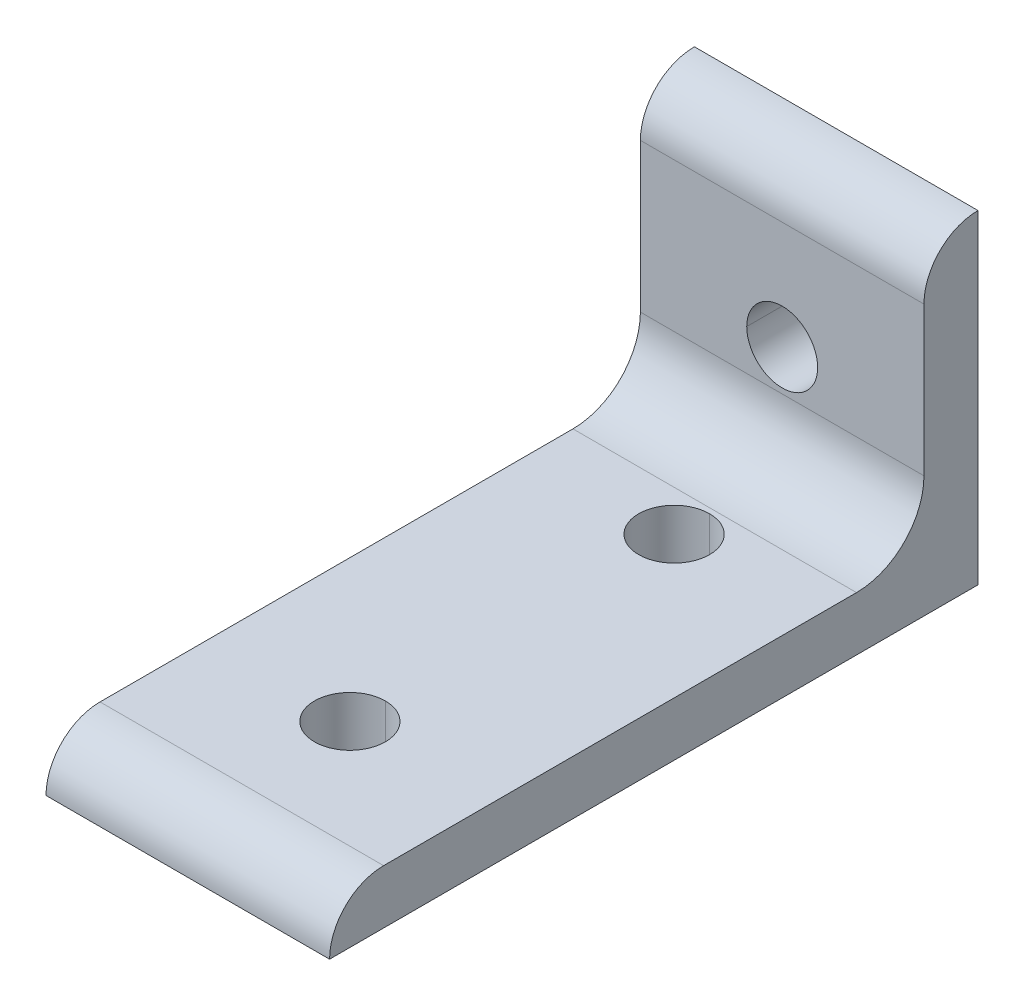
ISO-10303-21;
HEADER;
FILE_DESCRIPTION(('STEP AP214'),'2;1');
FILE_NAME('part.step','',(''),(''),'','','');
FILE_SCHEMA(('AUTOMOTIVE_DESIGN { 1 0 10303 214 1 1 1 1 }'));
ENDSEC;
DATA;
#1=APPLICATION_CONTEXT('core data for automotive mechanical design processes');
#2=APPLICATION_PROTOCOL_DEFINITION('international standard','automotive_design',2000,#1);
#3=PRODUCT_CONTEXT('',#1,'mechanical');
#4=PRODUCT('Part','Part','',(#3));
#5=PRODUCT_RELATED_PRODUCT_CATEGORY('part','',(#4));
#6=PRODUCT_DEFINITION_FORMATION('','',#4);
#7=PRODUCT_DEFINITION_CONTEXT('part definition',#1,'design');
#8=PRODUCT_DEFINITION('design','',#6,#7);
#9=PRODUCT_DEFINITION_SHAPE('','',#8);
#10=(LENGTH_UNIT() NAMED_UNIT(*) SI_UNIT(.MILLI.,.METRE.));
#11=(NAMED_UNIT(*) PLANE_ANGLE_UNIT() SI_UNIT($,.RADIAN.));
#12=(NAMED_UNIT(*) SI_UNIT($,.STERADIAN.) SOLID_ANGLE_UNIT());
#13=UNCERTAINTY_MEASURE_WITH_UNIT(LENGTH_MEASURE(1.E-05),#10,'distance_accuracy_value','');
#14=(GEOMETRIC_REPRESENTATION_CONTEXT(3) GLOBAL_UNCERTAINTY_ASSIGNED_CONTEXT((#13)) GLOBAL_UNIT_ASSIGNED_CONTEXT((#10,
#11,#12)) REPRESENTATION_CONTEXT('',''));
#15=CARTESIAN_POINT('',(0.,0.,0.));
#16=DIRECTION('',(0.,0.,1.));
#17=DIRECTION('',(1.,0.,0.));
#18=AXIS2_PLACEMENT_3D('',#15,#16,#17);
#19=CARTESIAN_POINT('',(16.6624,-1.44675937896466E-12,69.8499999999986));
#20=DIRECTION('',(-1.,0.,0.));
#21=DIRECTION('',(0.,-0.70710678118655,-0.707106781186545));
#22=AXIS2_PLACEMENT_3D('',#19,#20,#21);
#23=CYLINDRICAL_SURFACE('',#22,6.35000000000145);
#24=CARTESIAN_POINT('',(-16.6624,-1.44675937896466E-12,69.8499999999986));
#25=DIRECTION('',(1.,0.,0.));
#26=DIRECTION('',(0.,0.,-1.));
#27=AXIS2_PLACEMENT_3D('',#24,#25,#26);
#28=CIRCLE('',#27,6.35000000000145);
#29=CARTESIAN_POINT('',(-16.6624,6.35,69.85));
#30=VERTEX_POINT('',#29);
#31=CARTESIAN_POINT('',(-16.6624,0.,76.2));
#32=VERTEX_POINT('',#31);
#33=EDGE_CURVE('E11',#30,#32,#28,.T.);
#34=ORIENTED_EDGE('',*,*,#33,.T.);
#35=DIRECTION('',(-1.,0.,0.));
#36=VECTOR('',#35,1.);
#37=CARTESIAN_POINT('',(16.6624,0.,76.2));
#38=LINE('',#37,#36);
#39=CARTESIAN_POINT('',(16.6624,0.,76.2));
#40=VERTEX_POINT('',#39);
#41=EDGE_CURVE('E24',#40,#32,#38,.T.);
#42=ORIENTED_EDGE('',*,*,#41,.F.);
#43=CARTESIAN_POINT('',(16.6624,-1.44675937896466E-12,69.8499999999986));
#44=DIRECTION('',(1.,0.,0.));
#45=DIRECTION('',(0.,0.,-1.));
#46=AXIS2_PLACEMENT_3D('',#43,#44,#45);
#47=CIRCLE('',#46,6.35000000000145);
#48=CARTESIAN_POINT('',(16.6624,6.35,69.85));
#49=VERTEX_POINT('',#48);
#50=EDGE_CURVE('E267',#49,#40,#47,.T.);
#51=ORIENTED_EDGE('',*,*,#50,.F.);
#52=DIRECTION('',(-1.,0.,0.));
#53=VECTOR('',#52,1.);
#54=CARTESIAN_POINT('',(16.6624,6.35,69.85));
#55=LINE('',#54,#53);
#56=EDGE_CURVE('E263',#49,#30,#55,.T.);
#57=ORIENTED_EDGE('',*,*,#56,.T.);
#58=EDGE_LOOP('',(#34,#42,#51,#57));
#59=FACE_BOUND('',#58,.T.);
#60=ADVANCED_FACE('F16',(#59),#23,.T.);
#61=CARTESIAN_POINT('',(16.6624,6.35,14.2748));
#62=DIRECTION('',(0.,-1.,0.));
#63=DIRECTION('',(0.,0.,-1.));
#64=AXIS2_PLACEMENT_3D('',#61,#62,#63);
#65=PLANE('',#64);
#66=CARTESIAN_POINT('',(0.,6.35,57.15));
#67=DIRECTION('',(0.,1.,0.));
#68=DIRECTION('',(1.,0.,0.));
#69=AXIS2_PLACEMENT_3D('',#66,#67,#68);
#70=CIRCLE('',#69,4.1656);
#71=CARTESIAN_POINT('',(0.,6.35,52.9844));
#72=VERTEX_POINT('',#71);
#73=CARTESIAN_POINT('',(0.,6.35,61.3156));
#74=VERTEX_POINT('',#73);
#75=EDGE_CURVE('E258',#72,#74,#70,.T.);
#76=ORIENTED_EDGE('',*,*,#75,.F.);
#77=CARTESIAN_POINT('',(0.,6.35,57.15));
#78=DIRECTION('',(0.,1.,0.));
#79=DIRECTION('',(0.,0.,1.));
#80=AXIS2_PLACEMENT_3D('',#77,#78,#79);
#81=CIRCLE('',#80,4.1656);
#82=EDGE_CURVE('E253',#74,#72,#81,.T.);
#83=ORIENTED_EDGE('',*,*,#82,.F.);
#84=EDGE_LOOP('',(#76,#83));
#85=FACE_BOUND('',#84,.T.);
#86=CARTESIAN_POINT('',(0.,6.35,19.05));
#87=DIRECTION('',(0.,1.,0.));
#88=DIRECTION('',(1.,0.,0.));
#89=AXIS2_PLACEMENT_3D('',#86,#87,#88);
#90=CIRCLE('',#89,4.1656);
#91=CARTESIAN_POINT('',(0.,6.35,14.8844));
#92=VERTEX_POINT('',#91);
#93=CARTESIAN_POINT('',(0.,6.35,23.2156));
#94=VERTEX_POINT('',#93);
#95=EDGE_CURVE('E249',#92,#94,#90,.T.);
#96=ORIENTED_EDGE('',*,*,#95,.F.);
#97=CARTESIAN_POINT('',(0.,6.35,19.05));
#98=DIRECTION('',(0.,1.,0.));
#99=DIRECTION('',(0.,0.,1.));
#100=AXIS2_PLACEMENT_3D('',#97,#98,#99);
#101=CIRCLE('',#100,4.1656);
#102=EDGE_CURVE('E127',#94,#92,#101,.T.);
#103=ORIENTED_EDGE('',*,*,#102,.F.);
#104=EDGE_LOOP('',(#96,#103));
#105=FACE_BOUND('',#104,.T.);
#106=DIRECTION('',(0.,0.,1.));
#107=VECTOR('',#106,1.);
#108=CARTESIAN_POINT('',(-16.6624,6.35,14.2748));
#109=LINE('',#108,#107);
#110=CARTESIAN_POINT('',(-16.6624,6.35,14.2748));
#111=VERTEX_POINT('',#110);
#112=EDGE_CURVE('E241',#111,#30,#109,.T.);
#113=ORIENTED_EDGE('',*,*,#112,.T.);
#114=ORIENTED_EDGE('',*,*,#56,.F.);
#115=DIRECTION('',(0.,0.,1.));
#116=VECTOR('',#115,1.);
#117=CARTESIAN_POINT('',(16.6624,6.35,14.2748));
#118=LINE('',#117,#116);
#119=CARTESIAN_POINT('',(16.6624,6.35,14.2748));
#120=VERTEX_POINT('',#119);
#121=EDGE_CURVE('E236',#120,#49,#118,.T.);
#122=ORIENTED_EDGE('',*,*,#121,.F.);
#123=DIRECTION('',(-1.,0.,0.));
#124=VECTOR('',#123,1.);
#125=CARTESIAN_POINT('',(16.6624,6.35,14.2748));
#126=LINE('',#125,#124);
#127=EDGE_CURVE('E232',#120,#111,#126,.T.);
#128=ORIENTED_EDGE('',*,*,#127,.T.);
#129=EDGE_LOOP('',(#113,#114,#122,#128));
#130=FACE_BOUND('',#129,.T.);
#131=ADVANCED_FACE('F284',(#85,#105,#130),#65,.F.);
#132=CARTESIAN_POINT('',(16.6624,14.2748000000002,14.2748000000002));
#133=DIRECTION('',(-1.,0.,0.));
#134=DIRECTION('',(0.,0.707106781186537,0.707106781186558));
#135=AXIS2_PLACEMENT_3D('',#132,#133,#134);
#136=CYLINDRICAL_SURFACE('',#135,7.92480000000024);
#137=CARTESIAN_POINT('',(-16.6624,14.2748000000002,14.2748000000002));
#138=DIRECTION('',(1.,0.,0.));
#139=DIRECTION('',(0.,0.,-1.));
#140=AXIS2_PLACEMENT_3D('',#137,#138,#139);
#141=CIRCLE('',#140,7.92480000000024);
#142=CARTESIAN_POINT('',(-16.6624,14.2748,6.35));
#143=VERTEX_POINT('',#142);
#144=EDGE_CURVE('E227',#111,#143,#141,.T.);
#145=ORIENTED_EDGE('',*,*,#144,.F.);
#146=ORIENTED_EDGE('',*,*,#127,.F.);
#147=CARTESIAN_POINT('',(16.6624,14.2748000000002,14.2748000000002));
#148=DIRECTION('',(1.,0.,0.));
#149=DIRECTION('',(0.,0.,-1.));
#150=AXIS2_PLACEMENT_3D('',#147,#148,#149);
#151=CIRCLE('',#150,7.92480000000024);
#152=CARTESIAN_POINT('',(16.6624,14.2748,6.35));
#153=VERTEX_POINT('',#152);
#154=EDGE_CURVE('E223',#120,#153,#151,.T.);
#155=ORIENTED_EDGE('',*,*,#154,.T.);
#156=DIRECTION('',(-1.,0.,0.));
#157=VECTOR('',#156,1.);
#158=CARTESIAN_POINT('',(16.6624,14.2748,6.35));
#159=LINE('',#158,#157);
#160=EDGE_CURVE('E219',#153,#143,#159,.T.);
#161=ORIENTED_EDGE('',*,*,#160,.T.);
#162=EDGE_LOOP('',(#145,#146,#155,#161));
#163=FACE_BOUND('',#162,.T.);
#164=ADVANCED_FACE('F301',(#163),#136,.F.);
#165=CARTESIAN_POINT('',(16.6624,31.75,6.35));
#166=DIRECTION('',(0.,0.,-1.));
#167=DIRECTION('',(-1.,0.,0.));
#168=AXIS2_PLACEMENT_3D('',#165,#166,#167);
#169=PLANE('',#168);
#170=CARTESIAN_POINT('',(0.,19.05,6.35));
#171=DIRECTION('',(0.,0.,1.));
#172=DIRECTION('',(1.,0.,0.));
#173=AXIS2_PLACEMENT_3D('',#170,#171,#172);
#174=CIRCLE('',#173,4.1656);
#175=CARTESIAN_POINT('',(-4.1656,19.05,6.35));
#176=VERTEX_POINT('',#175);
#177=CARTESIAN_POINT('',(4.1656,19.05,6.35));
#178=VERTEX_POINT('',#177);
#179=EDGE_CURVE('E214',#176,#178,#174,.T.);
#180=ORIENTED_EDGE('',*,*,#179,.F.);
#181=CARTESIAN_POINT('',(0.,19.05,6.35));
#182=DIRECTION('',(0.,0.,1.));
#183=DIRECTION('',(1.,0.,0.));
#184=AXIS2_PLACEMENT_3D('',#181,#182,#183);
#185=CIRCLE('',#184,4.1656);
#186=EDGE_CURVE('E209',#178,#176,#185,.T.);
#187=ORIENTED_EDGE('',*,*,#186,.F.);
#188=EDGE_LOOP('',(#180,#187));
#189=FACE_BOUND('',#188,.T.);
#190=DIRECTION('',(0.,-1.,0.));
#191=VECTOR('',#190,1.);
#192=CARTESIAN_POINT('',(-16.6624,31.75,6.35));
#193=LINE('',#192,#191);
#194=CARTESIAN_POINT('',(-16.6624,31.75,6.35));
#195=VERTEX_POINT('',#194);
#196=EDGE_CURVE('E204',#195,#143,#193,.T.);
#197=ORIENTED_EDGE('',*,*,#196,.T.);
#198=ORIENTED_EDGE('',*,*,#160,.F.);
#199=DIRECTION('',(0.,-1.,0.));
#200=VECTOR('',#199,1.);
#201=CARTESIAN_POINT('',(16.6624,31.75,6.35));
#202=LINE('',#201,#200);
#203=CARTESIAN_POINT('',(16.6624,31.75,6.35));
#204=VERTEX_POINT('',#203);
#205=EDGE_CURVE('E199',#204,#153,#202,.T.);
#206=ORIENTED_EDGE('',*,*,#205,.F.);
#207=DIRECTION('',(-1.,0.,0.));
#208=VECTOR('',#207,1.);
#209=CARTESIAN_POINT('',(16.6624,31.75,6.35));
#210=LINE('',#209,#208);
#211=EDGE_CURVE('E195',#204,#195,#210,.T.);
#212=ORIENTED_EDGE('',*,*,#211,.T.);
#213=EDGE_LOOP('',(#197,#198,#206,#212));
#214=FACE_BOUND('',#213,.T.);
#215=ADVANCED_FACE('F299',(#189,#214),#169,.F.);
#216=CARTESIAN_POINT('',(16.6624,31.7499999999986,-1.46020348590348E-12));
#217=DIRECTION('',(-1.,0.,0.));
#218=DIRECTION('',(0.,-0.707106781186547,-0.707106781186548));
#219=AXIS2_PLACEMENT_3D('',#216,#217,#218);
#220=CYLINDRICAL_SURFACE('',#219,6.35000000000146);
#221=CARTESIAN_POINT('',(-16.6624,31.7499999999986,-1.46020348590348E-12));
#222=DIRECTION('',(1.,0.,0.));
#223=DIRECTION('',(0.,0.,-1.));
#224=AXIS2_PLACEMENT_3D('',#221,#222,#223);
#225=CIRCLE('',#224,6.35000000000146);
#226=CARTESIAN_POINT('',(-16.6624,38.1,0.));
#227=VERTEX_POINT('',#226);
#228=EDGE_CURVE('E190',#227,#195,#225,.T.);
#229=ORIENTED_EDGE('',*,*,#228,.T.);
#230=ORIENTED_EDGE('',*,*,#211,.F.);
#231=CARTESIAN_POINT('',(16.6624,31.7499999999986,-1.46020348590348E-12));
#232=DIRECTION('',(1.,0.,0.));
#233=DIRECTION('',(0.,0.,-1.));
#234=AXIS2_PLACEMENT_3D('',#231,#232,#233);
#235=CIRCLE('',#234,6.35000000000146);
#236=CARTESIAN_POINT('',(16.6624,38.1,0.));
#237=VERTEX_POINT('',#236);
#238=EDGE_CURVE('E185',#237,#204,#235,.T.);
#239=ORIENTED_EDGE('',*,*,#238,.F.);
#240=DIRECTION('',(-1.,0.,0.));
#241=VECTOR('',#240,1.);
#242=CARTESIAN_POINT('',(16.6624,38.1,0.));
#243=LINE('',#242,#241);
#244=EDGE_CURVE('E181',#237,#227,#243,.T.);
#245=ORIENTED_EDGE('',*,*,#244,.T.);
#246=EDGE_LOOP('',(#229,#230,#239,#245));
#247=FACE_BOUND('',#246,.T.);
#248=ADVANCED_FACE('F297',(#247),#220,.T.);
#249=CARTESIAN_POINT('',(16.6624,0.,0.));
#250=DIRECTION('',(0.,0.,1.));
#251=DIRECTION('',(1.,0.,0.));
#252=AXIS2_PLACEMENT_3D('',#249,#250,#251);
#253=PLANE('',#252);
#254=CARTESIAN_POINT('',(0.,19.05,0.));
#255=DIRECTION('',(0.,0.,1.));
#256=DIRECTION('',(1.,0.,0.));
#257=AXIS2_PLACEMENT_3D('',#254,#255,#256);
#258=CIRCLE('',#257,4.1656);
#259=CARTESIAN_POINT('',(4.1656,19.05,0.));
#260=VERTEX_POINT('',#259);
#261=CARTESIAN_POINT('',(-4.1656,19.05,0.));
#262=VERTEX_POINT('',#261);
#263=EDGE_CURVE('E177',#260,#262,#258,.T.);
#264=ORIENTED_EDGE('',*,*,#263,.T.);
#265=CARTESIAN_POINT('',(0.,19.05,0.));
#266=DIRECTION('',(0.,0.,1.));
#267=DIRECTION('',(1.,0.,0.));
#268=AXIS2_PLACEMENT_3D('',#265,#266,#267);
#269=CIRCLE('',#268,4.1656);
#270=EDGE_CURVE('E173',#262,#260,#269,.T.);
#271=ORIENTED_EDGE('',*,*,#270,.T.);
#272=EDGE_LOOP('',(#264,#271));
#273=FACE_BOUND('',#272,.T.);
#274=DIRECTION('',(0.,1.,0.));
#275=VECTOR('',#274,1.);
#276=CARTESIAN_POINT('',(-16.6624,0.,0.));
#277=LINE('',#276,#275);
#278=CARTESIAN_POINT('',(-16.6624,0.,0.));
#279=VERTEX_POINT('',#278);
#280=EDGE_CURVE('E168',#279,#227,#277,.T.);
#281=ORIENTED_EDGE('',*,*,#280,.T.);
#282=ORIENTED_EDGE('',*,*,#244,.F.);
#283=DIRECTION('',(0.,1.,0.));
#284=VECTOR('',#283,1.);
#285=CARTESIAN_POINT('',(16.6624,0.,0.));
#286=LINE('',#285,#284);
#287=CARTESIAN_POINT('',(16.6624,0.,0.));
#288=VERTEX_POINT('',#287);
#289=EDGE_CURVE('E163',#288,#237,#286,.T.);
#290=ORIENTED_EDGE('',*,*,#289,.F.);
#291=DIRECTION('',(-1.,0.,0.));
#292=VECTOR('',#291,1.);
#293=CARTESIAN_POINT('',(16.6624,0.,0.));
#294=LINE('',#293,#292);
#295=EDGE_CURVE('E159',#288,#279,#294,.T.);
#296=ORIENTED_EDGE('',*,*,#295,.T.);
#297=EDGE_LOOP('',(#281,#282,#290,#296));
#298=FACE_BOUND('',#297,.T.);
#299=ADVANCED_FACE('F293',(#273,#298),#253,.F.);
#300=CARTESIAN_POINT('',(16.6624,0.,76.2));
#301=DIRECTION('',(0.,1.,0.));
#302=DIRECTION('',(0.,0.,1.));
#303=AXIS2_PLACEMENT_3D('',#300,#301,#302);
#304=PLANE('',#303);
#305=CARTESIAN_POINT('',(0.,0.,57.15));
#306=DIRECTION('',(0.,1.,0.));
#307=DIRECTION('',(1.,0.,0.));
#308=AXIS2_PLACEMENT_3D('',#305,#306,#307);
#309=CIRCLE('',#308,4.1656);
#310=CARTESIAN_POINT('',(0.,0.,52.9844));
#311=VERTEX_POINT('',#310);
#312=CARTESIAN_POINT('',(0.,0.,61.3156));
#313=VERTEX_POINT('',#312);
#314=EDGE_CURVE('E155',#311,#313,#309,.T.);
#315=ORIENTED_EDGE('',*,*,#314,.T.);
#316=CARTESIAN_POINT('',(0.,0.,57.15));
#317=DIRECTION('',(0.,1.,0.));
#318=DIRECTION('',(0.,0.,1.));
#319=AXIS2_PLACEMENT_3D('',#316,#317,#318);
#320=CIRCLE('',#319,4.1656);
#321=EDGE_CURVE('E124',#313,#311,#320,.T.);
#322=ORIENTED_EDGE('',*,*,#321,.T.);
#323=EDGE_LOOP('',(#315,#322));
#324=FACE_BOUND('',#323,.T.);
#325=CARTESIAN_POINT('',(0.,0.,19.05));
#326=DIRECTION('',(0.,1.,0.));
#327=DIRECTION('',(1.,0.,0.));
#328=AXIS2_PLACEMENT_3D('',#325,#326,#327);
#329=CIRCLE('',#328,4.1656);
#330=CARTESIAN_POINT('',(0.,0.,14.8844));
#331=VERTEX_POINT('',#330);
#332=CARTESIAN_POINT('',(0.,0.,23.2156));
#333=VERTEX_POINT('',#332);
#334=EDGE_CURVE('E110',#331,#333,#329,.T.);
#335=ORIENTED_EDGE('',*,*,#334,.T.);
#336=CARTESIAN_POINT('',(0.,0.,19.05));
#337=DIRECTION('',(0.,1.,0.));
#338=DIRECTION('',(0.,0.,1.));
#339=AXIS2_PLACEMENT_3D('',#336,#337,#338);
#340=CIRCLE('',#339,4.1656);
#341=EDGE_CURVE('E106',#333,#331,#340,.T.);
#342=ORIENTED_EDGE('',*,*,#341,.T.);
#343=EDGE_LOOP('',(#335,#342));
#344=FACE_BOUND('',#343,.T.);
#345=DIRECTION('',(0.,0.,-1.));
#346=VECTOR('',#345,1.);
#347=CARTESIAN_POINT('',(-16.6624,0.,76.2));
#348=LINE('',#347,#346);
#349=EDGE_CURVE('E115',#32,#279,#348,.T.);
#350=ORIENTED_EDGE('',*,*,#349,.T.);
#351=ORIENTED_EDGE('',*,*,#295,.F.);
#352=DIRECTION('',(0.,0.,-1.));
#353=VECTOR('',#352,1.);
#354=CARTESIAN_POINT('',(16.6624,0.,76.2));
#355=LINE('',#354,#353);
#356=EDGE_CURVE('E130',#40,#288,#355,.T.);
#357=ORIENTED_EDGE('',*,*,#356,.F.);
#358=ORIENTED_EDGE('',*,*,#41,.T.);
#359=EDGE_LOOP('',(#350,#351,#357,#358));
#360=FACE_BOUND('',#359,.T.);
#361=ADVANCED_FACE('F108',(#324,#344,#360),#304,.F.);
#362=CARTESIAN_POINT('',(16.6624,-1.44675937896466E-12,69.8499999999986));
#363=DIRECTION('',(1.,0.,0.));
#364=DIRECTION('',(0.,0.,-1.));
#365=AXIS2_PLACEMENT_3D('',#362,#363,#364);
#366=PLANE('',#365);
#367=ORIENTED_EDGE('',*,*,#50,.T.);
#368=ORIENTED_EDGE('',*,*,#356,.T.);
#369=ORIENTED_EDGE('',*,*,#289,.T.);
#370=ORIENTED_EDGE('',*,*,#238,.T.);
#371=ORIENTED_EDGE('',*,*,#205,.T.);
#372=ORIENTED_EDGE('',*,*,#154,.F.);
#373=ORIENTED_EDGE('',*,*,#121,.T.);
#374=EDGE_LOOP('',(#367,#368,#369,#370,#371,#372,#373));
#375=FACE_BOUND('',#374,.T.);
#376=ADVANCED_FACE('F279',(#375),#366,.T.);
#377=CARTESIAN_POINT('',(-16.6624,-1.44675937896466E-12,69.8499999999986));
#378=DIRECTION('',(1.,0.,0.));
#379=DIRECTION('',(0.,0.,-1.));
#380=AXIS2_PLACEMENT_3D('',#377,#378,#379);
#381=PLANE('',#380);
#382=ORIENTED_EDGE('',*,*,#33,.F.);
#383=ORIENTED_EDGE('',*,*,#112,.F.);
#384=ORIENTED_EDGE('',*,*,#144,.T.);
#385=ORIENTED_EDGE('',*,*,#196,.F.);
#386=ORIENTED_EDGE('',*,*,#228,.F.);
#387=ORIENTED_EDGE('',*,*,#280,.F.);
#388=ORIENTED_EDGE('',*,*,#349,.F.);
#389=EDGE_LOOP('',(#382,#383,#384,#385,#386,#387,#388));
#390=FACE_BOUND('',#389,.T.);
#391=ADVANCED_FACE('F288',(#390),#381,.F.);
#392=CARTESIAN_POINT('',(0.,6.35,19.05));
#393=DIRECTION('',(0.,-1.,0.));
#394=DIRECTION('',(-1.,0.,0.));
#395=AXIS2_PLACEMENT_3D('',#392,#393,#394);
#396=CYLINDRICAL_SURFACE('',#395,4.1656);
#397=DIRECTION('',(0.,-1.,0.));
#398=VECTOR('',#397,1.);
#399=CARTESIAN_POINT('',(0.,6.35,23.2156));
#400=LINE('',#399,#398);
#401=EDGE_CURVE('E123',#94,#333,#400,.T.);
#402=ORIENTED_EDGE('',*,*,#401,.F.);
#403=ORIENTED_EDGE('',*,*,#102,.T.);
#404=DIRECTION('',(0.,-1.,0.));
#405=VECTOR('',#404,1.);
#406=CARTESIAN_POINT('',(0.,6.35,14.8844));
#407=LINE('',#406,#405);
#408=EDGE_CURVE('E121',#92,#331,#407,.T.);
#409=ORIENTED_EDGE('',*,*,#408,.T.);
#410=ORIENTED_EDGE('',*,*,#341,.F.);
#411=EDGE_LOOP('',(#402,#403,#409,#410));
#412=FACE_BOUND('',#411,.T.);
#413=ADVANCED_FACE('F126',(#412),#396,.F.);
#414=CARTESIAN_POINT('',(0.,6.35,19.05));
#415=DIRECTION('',(0.,-1.,0.));
#416=DIRECTION('',(1.,0.,0.));
#417=AXIS2_PLACEMENT_3D('',#414,#415,#416);
#418=CYLINDRICAL_SURFACE('',#417,4.1656);
#419=ORIENTED_EDGE('',*,*,#401,.T.);
#420=ORIENTED_EDGE('',*,*,#334,.F.);
#421=ORIENTED_EDGE('',*,*,#408,.F.);
#422=ORIENTED_EDGE('',*,*,#95,.T.);
#423=EDGE_LOOP('',(#419,#420,#421,#422));
#424=FACE_BOUND('',#423,.T.);
#425=ADVANCED_FACE('F119',(#424),#418,.F.);
#426=CARTESIAN_POINT('',(0.,6.35,57.15));
#427=DIRECTION('',(0.,-1.,0.));
#428=DIRECTION('',(-1.,0.,0.));
#429=AXIS2_PLACEMENT_3D('',#426,#427,#428);
#430=CYLINDRICAL_SURFACE('',#429,4.1656);
#431=DIRECTION('',(0.,-1.,0.));
#432=VECTOR('',#431,1.);
#433=CARTESIAN_POINT('',(0.,6.35,61.3156));
#434=LINE('',#433,#432);
#435=EDGE_CURVE('E128',#74,#313,#434,.T.);
#436=ORIENTED_EDGE('',*,*,#435,.F.);
#437=ORIENTED_EDGE('',*,*,#82,.T.);
#438=DIRECTION('',(0.,-1.,0.));
#439=VECTOR('',#438,1.);
#440=CARTESIAN_POINT('',(0.,6.35,52.9844));
#441=LINE('',#440,#439);
#442=EDGE_CURVE('E133',#72,#311,#441,.T.);
#443=ORIENTED_EDGE('',*,*,#442,.T.);
#444=ORIENTED_EDGE('',*,*,#321,.F.);
#445=EDGE_LOOP('',(#436,#437,#443,#444));
#446=FACE_BOUND('',#445,.T.);
#447=ADVANCED_FACE('F393',(#446),#430,.F.);
#448=CARTESIAN_POINT('',(0.,6.35,57.15));
#449=DIRECTION('',(0.,-1.,0.));
#450=DIRECTION('',(1.,0.,0.));
#451=AXIS2_PLACEMENT_3D('',#448,#449,#450);
#452=CYLINDRICAL_SURFACE('',#451,4.1656);
#453=ORIENTED_EDGE('',*,*,#435,.T.);
#454=ORIENTED_EDGE('',*,*,#314,.F.);
#455=ORIENTED_EDGE('',*,*,#442,.F.);
#456=ORIENTED_EDGE('',*,*,#75,.T.);
#457=EDGE_LOOP('',(#453,#454,#455,#456));
#458=FACE_BOUND('',#457,.T.);
#459=ADVANCED_FACE('F402',(#458),#452,.F.);
#460=CARTESIAN_POINT('',(0.,19.05,6.35));
#461=DIRECTION('',(0.,0.,-1.));
#462=DIRECTION('',(0.,1.,0.));
#463=AXIS2_PLACEMENT_3D('',#460,#461,#462);
#464=CYLINDRICAL_SURFACE('',#463,4.1656);
#465=DIRECTION('',(0.,0.,-1.));
#466=VECTOR('',#465,1.);
#467=CARTESIAN_POINT('',(4.1656,19.05,6.35));
#468=LINE('',#467,#466);
#469=EDGE_CURVE('E476',#178,#260,#468,.T.);
#470=ORIENTED_EDGE('',*,*,#469,.T.);
#471=ORIENTED_EDGE('',*,*,#270,.F.);
#472=DIRECTION('',(0.,0.,-1.));
#473=VECTOR('',#472,1.);
#474=CARTESIAN_POINT('',(-4.1656,19.05,6.35));
#475=LINE('',#474,#473);
#476=EDGE_CURVE('E479',#176,#262,#475,.T.);
#477=ORIENTED_EDGE('',*,*,#476,.F.);
#478=ORIENTED_EDGE('',*,*,#179,.T.);
#479=EDGE_LOOP('',(#470,#471,#477,#478));
#480=FACE_BOUND('',#479,.T.);
#481=ADVANCED_FACE('F412',(#480),#464,.F.);
#482=CARTESIAN_POINT('',(0.,19.05,6.35));
#483=DIRECTION('',(0.,0.,-1.));
#484=DIRECTION('',(0.,-1.,0.));
#485=AXIS2_PLACEMENT_3D('',#482,#483,#484);
#486=CYLINDRICAL_SURFACE('',#485,4.1656);
#487=ORIENTED_EDGE('',*,*,#469,.F.);
#488=ORIENTED_EDGE('',*,*,#186,.T.);
#489=ORIENTED_EDGE('',*,*,#476,.T.);
#490=ORIENTED_EDGE('',*,*,#263,.F.);
#491=EDGE_LOOP('',(#487,#488,#489,#490));
#492=FACE_BOUND('',#491,.T.);
#493=ADVANCED_FACE('F422',(#492),#486,.F.);
#494=CLOSED_SHELL('',(#60,#131,#164,#215,#248,#299,#361,#376,#391,#413,#425,#447,#459,#481,#493));
#495=MANIFOLD_SOLID_BREP('B1',#494);
#496=ADVANCED_BREP_SHAPE_REPRESENTATION('',(#18,#495),#14);
#497=SHAPE_DEFINITION_REPRESENTATION(#9,#496);
ENDSEC;
END-ISO-10303-21;
